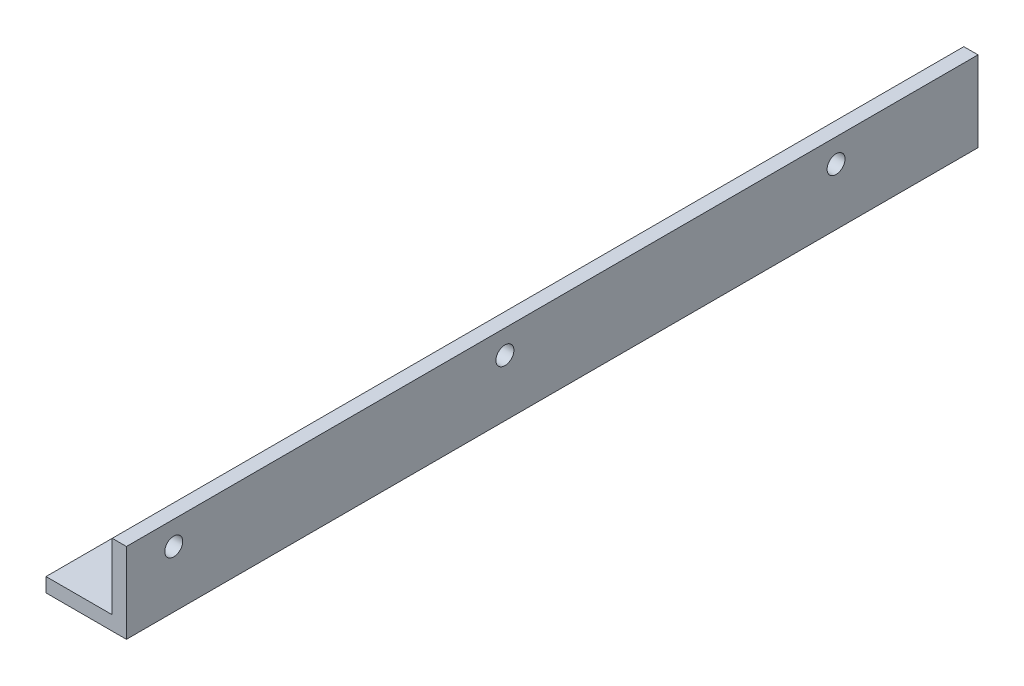
ISO-10303-21;
HEADER;
FILE_DESCRIPTION(('STEP AP214'),'2;1');
FILE_NAME('part.step','',(''),(''),'','','');
FILE_SCHEMA(('AUTOMOTIVE_DESIGN { 1 0 10303 214 1 1 1 1 }'));
ENDSEC;
DATA;
#1=APPLICATION_CONTEXT('core data for automotive mechanical design processes');
#2=APPLICATION_PROTOCOL_DEFINITION('international standard','automotive_design',2000,#1);
#3=PRODUCT_CONTEXT('',#1,'mechanical');
#4=PRODUCT('Part','Part','',(#3));
#5=PRODUCT_RELATED_PRODUCT_CATEGORY('part','',(#4));
#6=PRODUCT_DEFINITION_FORMATION('','',#4);
#7=PRODUCT_DEFINITION_CONTEXT('part definition',#1,'design');
#8=PRODUCT_DEFINITION('design','',#6,#7);
#9=PRODUCT_DEFINITION_SHAPE('','',#8);
#10=(LENGTH_UNIT() NAMED_UNIT(*) SI_UNIT(.MILLI.,.METRE.));
#11=(NAMED_UNIT(*) PLANE_ANGLE_UNIT() SI_UNIT($,.RADIAN.));
#12=(NAMED_UNIT(*) SI_UNIT($,.STERADIAN.) SOLID_ANGLE_UNIT());
#13=UNCERTAINTY_MEASURE_WITH_UNIT(LENGTH_MEASURE(1.E-05),#10,'distance_accuracy_value','');
#14=(GEOMETRIC_REPRESENTATION_CONTEXT(3) GLOBAL_UNCERTAINTY_ASSIGNED_CONTEXT((#13)) GLOBAL_UNIT_ASSIGNED_CONTEXT((#10,
#11,#12)) REPRESENTATION_CONTEXT('',''));
#15=CARTESIAN_POINT('',(0.,0.,0.));
#16=DIRECTION('',(0.,0.,1.));
#17=DIRECTION('',(1.,0.,0.));
#18=AXIS2_PLACEMENT_3D('',#15,#16,#17);
#19=CARTESIAN_POINT('',(-3.,3.,180.));
#20=DIRECTION('',(0.,-1.,0.));
#21=DIRECTION('',(1.,0.,0.));
#22=AXIS2_PLACEMENT_3D('',#19,#20,#21);
#23=PLANE('',#22);
#24=CARTESIAN_POINT('',(-12.,3.,20.));
#25=DIRECTION('',(0.,1.,0.));
#26=DIRECTION('',(0.,0.,1.));
#27=AXIS2_PLACEMENT_3D('',#24,#25,#26);
#28=CIRCLE('',#27,1.89864999999999);
#29=CARTESIAN_POINT('',(-12.,3.,21.89865));
#30=VERTEX_POINT('',#29);
#31=EDGE_CURVE('E248',#30,#30,#28,.T.);
#32=ORIENTED_EDGE('',*,*,#31,.F.);
#33=EDGE_LOOP('',(#32));
#34=FACE_BOUND('',#33,.T.);
#35=CARTESIAN_POINT('',(-12.,3.,90.));
#36=DIRECTION('',(0.,1.,0.));
#37=DIRECTION('',(0.,0.,1.));
#38=AXIS2_PLACEMENT_3D('',#35,#36,#37);
#39=CIRCLE('',#38,1.89864999999999);
#40=CARTESIAN_POINT('',(-12.,3.,91.89865));
#41=VERTEX_POINT('',#40);
#42=EDGE_CURVE('E240',#41,#41,#39,.T.);
#43=ORIENTED_EDGE('',*,*,#42,.F.);
#44=EDGE_LOOP('',(#43));
#45=FACE_BOUND('',#44,.T.);
#46=DIRECTION('',(-1.,0.,0.));
#47=VECTOR('',#46,1.);
#48=CARTESIAN_POINT('',(-3.,3.,0.));
#49=LINE('',#48,#47);
#50=CARTESIAN_POINT('',(-3.,3.,0.));
#51=VERTEX_POINT('',#50);
#52=CARTESIAN_POINT('',(-17.,3.,0.));
#53=VERTEX_POINT('',#52);
#54=EDGE_CURVE('E139',#51,#53,#49,.T.);
#55=ORIENTED_EDGE('',*,*,#54,.T.);
#56=DIRECTION('',(0.,0.,-1.));
#57=VECTOR('',#56,1.);
#58=CARTESIAN_POINT('',(-17.,3.,180.));
#59=LINE('',#58,#57);
#60=CARTESIAN_POINT('',(-17.,3.,180.));
#61=VERTEX_POINT('',#60);
#62=EDGE_CURVE('E120',#61,#53,#59,.T.);
#63=ORIENTED_EDGE('',*,*,#62,.F.);
#64=DIRECTION('',(-1.,0.,0.));
#65=VECTOR('',#64,1.);
#66=CARTESIAN_POINT('',(-3.,3.,180.));
#67=LINE('',#66,#65);
#68=CARTESIAN_POINT('',(-3.,3.,180.));
#69=VERTEX_POINT('',#68);
#70=EDGE_CURVE('E109',#69,#61,#67,.T.);
#71=ORIENTED_EDGE('',*,*,#70,.F.);
#72=DIRECTION('',(0.,0.,-1.));
#73=VECTOR('',#72,1.);
#74=CARTESIAN_POINT('',(-3.,3.,180.));
#75=LINE('',#74,#73);
#76=EDGE_CURVE('E51',#69,#51,#75,.T.);
#77=ORIENTED_EDGE('',*,*,#76,.T.);
#78=EDGE_LOOP('',(#55,#63,#71,#77));
#79=FACE_BOUND('',#78,.T.);
#80=CARTESIAN_POINT('',(-12.,3.,160.));
#81=DIRECTION('',(0.,1.,0.));
#82=DIRECTION('',(0.,0.,1.));
#83=AXIS2_PLACEMENT_3D('',#80,#81,#82);
#84=CIRCLE('',#83,1.89864999999999);
#85=CARTESIAN_POINT('',(-12.,3.,161.89865));
#86=VERTEX_POINT('',#85);
#87=EDGE_CURVE('E232',#86,#86,#84,.T.);
#88=ORIENTED_EDGE('',*,*,#87,.F.);
#89=EDGE_LOOP('',(#88));
#90=FACE_BOUND('',#89,.T.);
#91=ADVANCED_FACE('F41',(#34,#45,#79,#90),#23,.F.);
#92=CARTESIAN_POINT('',(0.,17.,180.));
#93=DIRECTION('',(0.,-1.,0.));
#94=DIRECTION('',(0.,0.,-1.));
#95=AXIS2_PLACEMENT_3D('',#92,#93,#94);
#96=PLANE('',#95);
#97=DIRECTION('',(-1.,0.,0.));
#98=VECTOR('',#97,1.);
#99=CARTESIAN_POINT('',(0.,17.,0.));
#100=LINE('',#99,#98);
#101=CARTESIAN_POINT('',(0.,17.,0.));
#102=VERTEX_POINT('',#101);
#103=CARTESIAN_POINT('',(-3.,17.,0.));
#104=VERTEX_POINT('',#103);
#105=EDGE_CURVE('E131',#102,#104,#100,.T.);
#106=ORIENTED_EDGE('',*,*,#105,.T.);
#107=DIRECTION('',(0.,0.,-1.));
#108=VECTOR('',#107,1.);
#109=CARTESIAN_POINT('',(-3.,17.,180.));
#110=LINE('',#109,#108);
#111=CARTESIAN_POINT('',(-3.,17.,180.));
#112=VERTEX_POINT('',#111);
#113=EDGE_CURVE('E11',#112,#104,#110,.T.);
#114=ORIENTED_EDGE('',*,*,#113,.F.);
#115=DIRECTION('',(-1.,0.,0.));
#116=VECTOR('',#115,1.);
#117=CARTESIAN_POINT('',(0.,17.,180.));
#118=LINE('',#117,#116);
#119=CARTESIAN_POINT('',(0.,17.,180.));
#120=VERTEX_POINT('',#119);
#121=EDGE_CURVE('E148',#120,#112,#118,.T.);
#122=ORIENTED_EDGE('',*,*,#121,.F.);
#123=DIRECTION('',(0.,0.,-1.));
#124=VECTOR('',#123,1.);
#125=CARTESIAN_POINT('',(0.,17.,180.));
#126=LINE('',#125,#124);
#127=EDGE_CURVE('E127',#120,#102,#126,.T.);
#128=ORIENTED_EDGE('',*,*,#127,.T.);
#129=EDGE_LOOP('',(#106,#114,#122,#128));
#130=FACE_BOUND('',#129,.T.);
#131=ADVANCED_FACE('F43',(#130),#96,.F.);
#132=CARTESIAN_POINT('',(-3.,17.,180.));
#133=DIRECTION('',(1.,0.,0.));
#134=DIRECTION('',(0.,1.,0.));
#135=AXIS2_PLACEMENT_3D('',#132,#133,#134);
#136=PLANE('',#135);
#137=CARTESIAN_POINT('',(-3.,12.,30.));
#138=DIRECTION('',(-1.,0.,0.));
#139=DIRECTION('',(0.,0.,1.));
#140=AXIS2_PLACEMENT_3D('',#137,#138,#139);
#141=CIRCLE('',#140,1.89864999999999);
#142=CARTESIAN_POINT('',(-3.,12.,31.89865));
#143=VERTEX_POINT('',#142);
#144=EDGE_CURVE('E197',#143,#143,#141,.T.);
#145=ORIENTED_EDGE('',*,*,#144,.F.);
#146=EDGE_LOOP('',(#145));
#147=FACE_BOUND('',#146,.T.);
#148=CARTESIAN_POINT('',(-3.,12.,100.));
#149=DIRECTION('',(-1.,0.,0.));
#150=DIRECTION('',(0.,0.,1.));
#151=AXIS2_PLACEMENT_3D('',#148,#149,#150);
#152=CIRCLE('',#151,1.89864999999999);
#153=CARTESIAN_POINT('',(-3.,12.,101.89865));
#154=VERTEX_POINT('',#153);
#155=EDGE_CURVE('E201',#154,#154,#152,.T.);
#156=ORIENTED_EDGE('',*,*,#155,.F.);
#157=EDGE_LOOP('',(#156));
#158=FACE_BOUND('',#157,.T.);
#159=CARTESIAN_POINT('',(-3.,12.,170.));
#160=DIRECTION('',(-1.,0.,0.));
#161=DIRECTION('',(0.,0.,1.));
#162=AXIS2_PLACEMENT_3D('',#159,#160,#161);
#163=CIRCLE('',#162,1.89864999999999);
#164=CARTESIAN_POINT('',(-3.,12.,171.89865));
#165=VERTEX_POINT('',#164);
#166=EDGE_CURVE('E204',#165,#165,#163,.T.);
#167=ORIENTED_EDGE('',*,*,#166,.F.);
#168=EDGE_LOOP('',(#167));
#169=FACE_BOUND('',#168,.T.);
#170=DIRECTION('',(0.,-1.,0.));
#171=VECTOR('',#170,1.);
#172=CARTESIAN_POINT('',(-3.,17.,0.));
#173=LINE('',#172,#171);
#174=EDGE_CURVE('E135',#104,#51,#173,.T.);
#175=ORIENTED_EDGE('',*,*,#174,.T.);
#176=ORIENTED_EDGE('',*,*,#76,.F.);
#177=DIRECTION('',(0.,-1.,0.));
#178=VECTOR('',#177,1.);
#179=CARTESIAN_POINT('',(-3.,17.,180.));
#180=LINE('',#179,#178);
#181=EDGE_CURVE('E96',#112,#69,#180,.T.);
#182=ORIENTED_EDGE('',*,*,#181,.F.);
#183=ORIENTED_EDGE('',*,*,#113,.T.);
#184=EDGE_LOOP('',(#175,#176,#182,#183));
#185=FACE_BOUND('',#184,.T.);
#186=ADVANCED_FACE('F185',(#147,#158,#169,#185),#136,.F.);
#187=CARTESIAN_POINT('',(-17.,3.,180.));
#188=DIRECTION('',(1.,0.,0.));
#189=DIRECTION('',(0.,0.,-1.));
#190=AXIS2_PLACEMENT_3D('',#187,#188,#189);
#191=PLANE('',#190);
#192=DIRECTION('',(0.,-1.,0.));
#193=VECTOR('',#192,1.);
#194=CARTESIAN_POINT('',(-17.,3.,0.));
#195=LINE('',#194,#193);
#196=CARTESIAN_POINT('',(-17.,0.,0.));
#197=VERTEX_POINT('',#196);
#198=EDGE_CURVE('E118',#53,#197,#195,.T.);
#199=ORIENTED_EDGE('',*,*,#198,.T.);
#200=DIRECTION('',(0.,0.,-1.));
#201=VECTOR('',#200,1.);
#202=CARTESIAN_POINT('',(-17.,0.,180.));
#203=LINE('',#202,#201);
#204=CARTESIAN_POINT('',(-17.,0.,180.));
#205=VERTEX_POINT('',#204);
#206=EDGE_CURVE('E115',#205,#197,#203,.T.);
#207=ORIENTED_EDGE('',*,*,#206,.F.);
#208=DIRECTION('',(0.,-1.,0.));
#209=VECTOR('',#208,1.);
#210=CARTESIAN_POINT('',(-17.,3.,180.));
#211=LINE('',#210,#209);
#212=EDGE_CURVE('E103',#61,#205,#211,.T.);
#213=ORIENTED_EDGE('',*,*,#212,.F.);
#214=ORIENTED_EDGE('',*,*,#62,.T.);
#215=EDGE_LOOP('',(#199,#207,#213,#214));
#216=FACE_BOUND('',#215,.T.);
#217=ADVANCED_FACE('F116',(#216),#191,.F.);
#218=CARTESIAN_POINT('',(-17.,0.,180.));
#219=DIRECTION('',(0.,1.,0.));
#220=DIRECTION('',(0.,0.,1.));
#221=AXIS2_PLACEMENT_3D('',#218,#219,#220);
#222=PLANE('',#221);
#223=CARTESIAN_POINT('',(-12.,0.,20.));
#224=DIRECTION('',(0.,1.,0.));
#225=DIRECTION('',(0.,0.,1.));
#226=AXIS2_PLACEMENT_3D('',#223,#224,#225);
#227=CIRCLE('',#226,1.89865);
#228=CARTESIAN_POINT('',(-12.,0.,21.89865));
#229=VERTEX_POINT('',#228);
#230=EDGE_CURVE('E244',#229,#229,#227,.T.);
#231=ORIENTED_EDGE('',*,*,#230,.T.);
#232=EDGE_LOOP('',(#231));
#233=FACE_BOUND('',#232,.T.);
#234=CARTESIAN_POINT('',(-12.,0.,90.));
#235=DIRECTION('',(0.,1.,0.));
#236=DIRECTION('',(0.,0.,1.));
#237=AXIS2_PLACEMENT_3D('',#234,#235,#236);
#238=CIRCLE('',#237,1.89865);
#239=CARTESIAN_POINT('',(-12.,0.,91.89865));
#240=VERTEX_POINT('',#239);
#241=EDGE_CURVE('E236',#240,#240,#238,.T.);
#242=ORIENTED_EDGE('',*,*,#241,.T.);
#243=EDGE_LOOP('',(#242));
#244=FACE_BOUND('',#243,.T.);
#245=CARTESIAN_POINT('',(-12.,0.,160.));
#246=DIRECTION('',(0.,1.,0.));
#247=DIRECTION('',(0.,0.,1.));
#248=AXIS2_PLACEMENT_3D('',#245,#246,#247);
#249=CIRCLE('',#248,1.89865);
#250=CARTESIAN_POINT('',(-12.,0.,161.89865));
#251=VERTEX_POINT('',#250);
#252=EDGE_CURVE('E228',#251,#251,#249,.T.);
#253=ORIENTED_EDGE('',*,*,#252,.T.);
#254=EDGE_LOOP('',(#253));
#255=FACE_BOUND('',#254,.T.);
#256=DIRECTION('',(1.,0.,0.));
#257=VECTOR('',#256,1.);
#258=CARTESIAN_POINT('',(-17.,0.,0.));
#259=LINE('',#258,#257);
#260=CARTESIAN_POINT('',(0.,0.,0.));
#261=VERTEX_POINT('',#260);
#262=EDGE_CURVE('E82',#197,#261,#259,.T.);
#263=ORIENTED_EDGE('',*,*,#262,.T.);
#264=DIRECTION('',(0.,0.,-1.));
#265=VECTOR('',#264,1.);
#266=CARTESIAN_POINT('',(0.,0.,180.));
#267=LINE('',#266,#265);
#268=CARTESIAN_POINT('',(0.,0.,180.));
#269=VERTEX_POINT('',#268);
#270=EDGE_CURVE('E121',#269,#261,#267,.T.);
#271=ORIENTED_EDGE('',*,*,#270,.F.);
#272=DIRECTION('',(1.,0.,0.));
#273=VECTOR('',#272,1.);
#274=CARTESIAN_POINT('',(-17.,0.,180.));
#275=LINE('',#274,#273);
#276=EDGE_CURVE('E107',#205,#269,#275,.T.);
#277=ORIENTED_EDGE('',*,*,#276,.F.);
#278=ORIENTED_EDGE('',*,*,#206,.T.);
#279=EDGE_LOOP('',(#263,#271,#277,#278));
#280=FACE_BOUND('',#279,.T.);
#281=ADVANCED_FACE('F123',(#233,#244,#255,#280),#222,.F.);
#282=CARTESIAN_POINT('',(0.,0.,180.));
#283=DIRECTION('',(-1.,0.,0.));
#284=DIRECTION('',(0.,0.,1.));
#285=AXIS2_PLACEMENT_3D('',#282,#283,#284);
#286=PLANE('',#285);
#287=CARTESIAN_POINT('',(0.,12.,30.));
#288=DIRECTION('',(-1.,0.,0.));
#289=DIRECTION('',(0.,0.,1.));
#290=AXIS2_PLACEMENT_3D('',#287,#288,#289);
#291=CIRCLE('',#290,1.89865);
#292=CARTESIAN_POINT('',(0.,12.,31.89865));
#293=VERTEX_POINT('',#292);
#294=EDGE_CURVE('E223',#293,#293,#291,.T.);
#295=ORIENTED_EDGE('',*,*,#294,.T.);
#296=EDGE_LOOP('',(#295));
#297=FACE_BOUND('',#296,.T.);
#298=CARTESIAN_POINT('',(0.,12.,100.));
#299=DIRECTION('',(-1.,0.,0.));
#300=DIRECTION('',(0.,0.,1.));
#301=AXIS2_PLACEMENT_3D('',#298,#299,#300);
#302=CIRCLE('',#301,1.89865);
#303=CARTESIAN_POINT('',(0.,12.,101.89865));
#304=VERTEX_POINT('',#303);
#305=EDGE_CURVE('E207',#304,#304,#302,.T.);
#306=ORIENTED_EDGE('',*,*,#305,.T.);
#307=EDGE_LOOP('',(#306));
#308=FACE_BOUND('',#307,.T.);
#309=CARTESIAN_POINT('',(0.,12.,170.));
#310=DIRECTION('',(-1.,0.,0.));
#311=DIRECTION('',(0.,0.,1.));
#312=AXIS2_PLACEMENT_3D('',#309,#310,#311);
#313=CIRCLE('',#312,1.89865);
#314=CARTESIAN_POINT('',(0.,12.,171.89865));
#315=VERTEX_POINT('',#314);
#316=EDGE_CURVE('E136',#315,#315,#313,.T.);
#317=ORIENTED_EDGE('',*,*,#316,.T.);
#318=EDGE_LOOP('',(#317));
#319=FACE_BOUND('',#318,.T.);
#320=DIRECTION('',(0.,1.,0.));
#321=VECTOR('',#320,1.);
#322=CARTESIAN_POINT('',(0.,0.,0.));
#323=LINE('',#322,#321);
#324=EDGE_CURVE('E88',#261,#102,#323,.T.);
#325=ORIENTED_EDGE('',*,*,#324,.T.);
#326=ORIENTED_EDGE('',*,*,#127,.F.);
#327=DIRECTION('',(0.,1.,0.));
#328=VECTOR('',#327,1.);
#329=CARTESIAN_POINT('',(0.,0.,180.));
#330=LINE('',#329,#328);
#331=EDGE_CURVE('E59',#269,#120,#330,.T.);
#332=ORIENTED_EDGE('',*,*,#331,.F.);
#333=ORIENTED_EDGE('',*,*,#270,.T.);
#334=EDGE_LOOP('',(#325,#326,#332,#333));
#335=FACE_BOUND('',#334,.T.);
#336=ADVANCED_FACE('F165',(#297,#308,#319,#335),#286,.F.);
#337=CARTESIAN_POINT('',(0.,0.,180.));
#338=DIRECTION('',(0.,0.,1.));
#339=DIRECTION('',(1.,0.,0.));
#340=AXIS2_PLACEMENT_3D('',#337,#338,#339);
#341=PLANE('',#340);
#342=ORIENTED_EDGE('',*,*,#121,.T.);
#343=ORIENTED_EDGE('',*,*,#181,.T.);
#344=ORIENTED_EDGE('',*,*,#70,.T.);
#345=ORIENTED_EDGE('',*,*,#212,.T.);
#346=ORIENTED_EDGE('',*,*,#276,.T.);
#347=ORIENTED_EDGE('',*,*,#331,.T.);
#348=EDGE_LOOP('',(#342,#343,#344,#345,#346,#347));
#349=FACE_BOUND('',#348,.T.);
#350=ADVANCED_FACE('F105',(#349),#341,.T.);
#351=CARTESIAN_POINT('',(0.,0.,0.));
#352=DIRECTION('',(0.,0.,1.));
#353=DIRECTION('',(1.,0.,0.));
#354=AXIS2_PLACEMENT_3D('',#351,#352,#353);
#355=PLANE('',#354);
#356=ORIENTED_EDGE('',*,*,#105,.F.);
#357=ORIENTED_EDGE('',*,*,#324,.F.);
#358=ORIENTED_EDGE('',*,*,#262,.F.);
#359=ORIENTED_EDGE('',*,*,#198,.F.);
#360=ORIENTED_EDGE('',*,*,#54,.F.);
#361=ORIENTED_EDGE('',*,*,#174,.F.);
#362=EDGE_LOOP('',(#356,#357,#358,#359,#360,#361));
#363=FACE_BOUND('',#362,.T.);
#364=ADVANCED_FACE('F161',(#363),#355,.F.);
#365=CARTESIAN_POINT('',(-3.,12.,170.));
#366=DIRECTION('',(-1.,0.,0.));
#367=DIRECTION('',(0.,0.,1.));
#368=AXIS2_PLACEMENT_3D('',#365,#366,#367);
#369=CYLINDRICAL_SURFACE('',#368,1.89864999999999);
#370=ORIENTED_EDGE('',*,*,#316,.F.);
#371=EDGE_LOOP('',(#370));
#372=FACE_BOUND('',#371,.T.);
#373=ORIENTED_EDGE('',*,*,#166,.T.);
#374=EDGE_LOOP('',(#373));
#375=FACE_BOUND('',#374,.T.);
#376=ADVANCED_FACE('F275',(#372,#375),#369,.F.);
#377=CARTESIAN_POINT('',(-3.,12.,100.));
#378=DIRECTION('',(-1.,0.,0.));
#379=DIRECTION('',(0.,0.,1.));
#380=AXIS2_PLACEMENT_3D('',#377,#378,#379);
#381=CYLINDRICAL_SURFACE('',#380,1.89864999999999);
#382=ORIENTED_EDGE('',*,*,#305,.F.);
#383=EDGE_LOOP('',(#382));
#384=FACE_BOUND('',#383,.T.);
#385=ORIENTED_EDGE('',*,*,#155,.T.);
#386=EDGE_LOOP('',(#385));
#387=FACE_BOUND('',#386,.T.);
#388=ADVANCED_FACE('F271',(#384,#387),#381,.F.);
#389=CARTESIAN_POINT('',(-3.,12.,30.));
#390=DIRECTION('',(-1.,0.,0.));
#391=DIRECTION('',(0.,0.,1.));
#392=AXIS2_PLACEMENT_3D('',#389,#390,#391);
#393=CYLINDRICAL_SURFACE('',#392,1.89864999999999);
#394=ORIENTED_EDGE('',*,*,#294,.F.);
#395=EDGE_LOOP('',(#394));
#396=FACE_BOUND('',#395,.T.);
#397=ORIENTED_EDGE('',*,*,#144,.T.);
#398=EDGE_LOOP('',(#397));
#399=FACE_BOUND('',#398,.T.);
#400=ADVANCED_FACE('F267',(#396,#399),#393,.F.);
#401=CARTESIAN_POINT('',(-12.,3.,160.));
#402=DIRECTION('',(0.,1.,0.));
#403=DIRECTION('',(0.,0.,1.));
#404=AXIS2_PLACEMENT_3D('',#401,#402,#403);
#405=CYLINDRICAL_SURFACE('',#404,1.89864999999999);
#406=ORIENTED_EDGE('',*,*,#252,.F.);
#407=EDGE_LOOP('',(#406));
#408=FACE_BOUND('',#407,.T.);
#409=ORIENTED_EDGE('',*,*,#87,.T.);
#410=EDGE_LOOP('',(#409));
#411=FACE_BOUND('',#410,.T.);
#412=ADVANCED_FACE('F260',(#408,#411),#405,.F.);
#413=CARTESIAN_POINT('',(-12.,3.,90.));
#414=DIRECTION('',(0.,1.,0.));
#415=DIRECTION('',(0.,0.,1.));
#416=AXIS2_PLACEMENT_3D('',#413,#414,#415);
#417=CYLINDRICAL_SURFACE('',#416,1.89864999999999);
#418=ORIENTED_EDGE('',*,*,#241,.F.);
#419=EDGE_LOOP('',(#418));
#420=FACE_BOUND('',#419,.T.);
#421=ORIENTED_EDGE('',*,*,#42,.T.);
#422=EDGE_LOOP('',(#421));
#423=FACE_BOUND('',#422,.T.);
#424=ADVANCED_FACE('F254',(#420,#423),#417,.F.);
#425=CARTESIAN_POINT('',(-12.,3.,20.));
#426=DIRECTION('',(0.,1.,0.));
#427=DIRECTION('',(0.,0.,1.));
#428=AXIS2_PLACEMENT_3D('',#425,#426,#427);
#429=CYLINDRICAL_SURFACE('',#428,1.89864999999999);
#430=ORIENTED_EDGE('',*,*,#230,.F.);
#431=EDGE_LOOP('',(#430));
#432=FACE_BOUND('',#431,.T.);
#433=ORIENTED_EDGE('',*,*,#31,.T.);
#434=EDGE_LOOP('',(#433));
#435=FACE_BOUND('',#434,.T.);
#436=ADVANCED_FACE('F252',(#432,#435),#429,.F.);
#437=CLOSED_SHELL('',(#91,#131,#186,#217,#281,#336,#350,#364,#376,#388,#400,#412,#424,#436));
#438=MANIFOLD_SOLID_BREP('B2',#437);
#439=ADVANCED_BREP_SHAPE_REPRESENTATION('',(#18,#438),#14);
#440=SHAPE_DEFINITION_REPRESENTATION(#9,#439);
ENDSEC;
END-ISO-10303-21;
